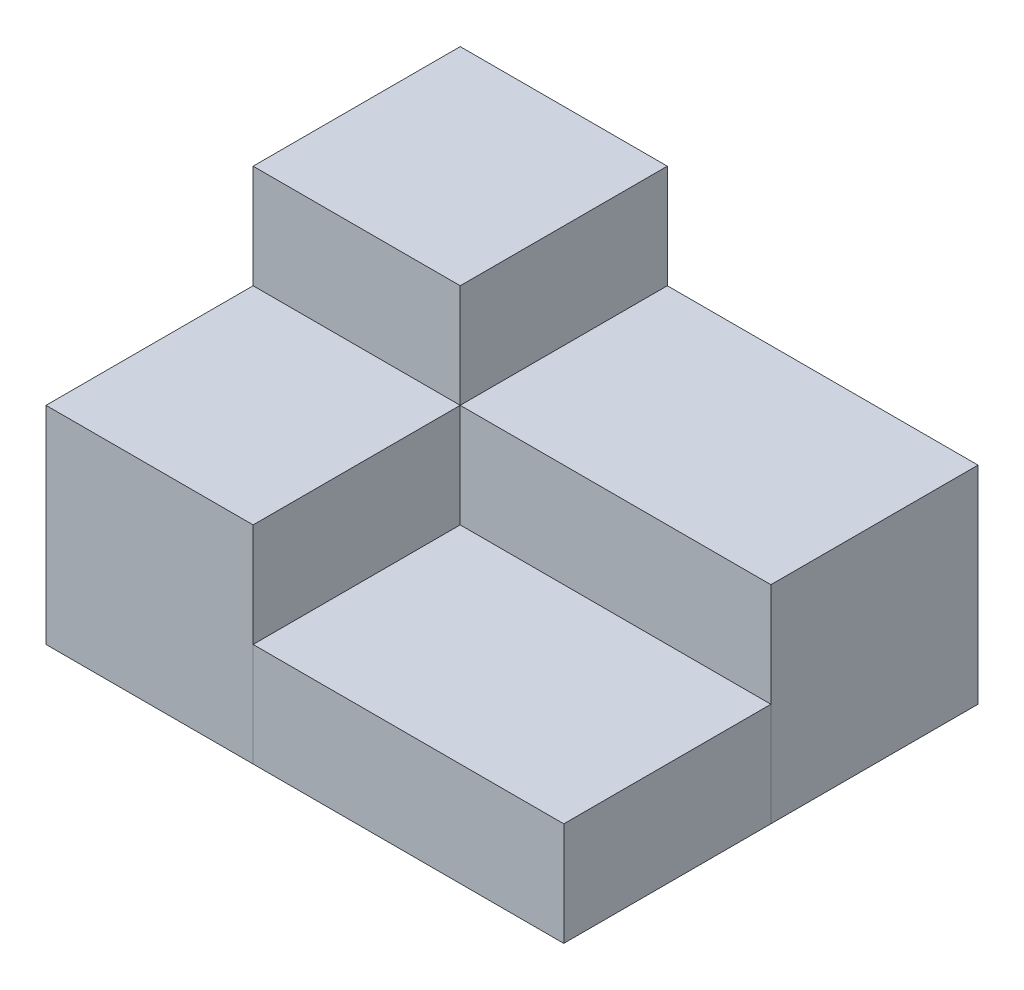
ISO-10303-21;
HEADER;
FILE_DESCRIPTION(('STEP AP214'),'2;1');
FILE_NAME('part.step','',(''),(''),'','','');
FILE_SCHEMA(('AUTOMOTIVE_DESIGN { 1 0 10303 214 1 1 1 1 }'));
ENDSEC;
DATA;
#1=APPLICATION_CONTEXT('core data for automotive mechanical design processes');
#2=APPLICATION_PROTOCOL_DEFINITION('international standard','automotive_design',2000,#1);
#3=PRODUCT_CONTEXT('',#1,'mechanical');
#4=PRODUCT('Part','Part','',(#3));
#5=PRODUCT_RELATED_PRODUCT_CATEGORY('part','',(#4));
#6=PRODUCT_DEFINITION_FORMATION('','',#4);
#7=PRODUCT_DEFINITION_CONTEXT('part definition',#1,'design');
#8=PRODUCT_DEFINITION('design','',#6,#7);
#9=PRODUCT_DEFINITION_SHAPE('','',#8);
#10=(LENGTH_UNIT() NAMED_UNIT(*) SI_UNIT(.MILLI.,.METRE.));
#11=(NAMED_UNIT(*) PLANE_ANGLE_UNIT() SI_UNIT($,.RADIAN.));
#12=(NAMED_UNIT(*) SI_UNIT($,.STERADIAN.) SOLID_ANGLE_UNIT());
#13=UNCERTAINTY_MEASURE_WITH_UNIT(LENGTH_MEASURE(1.E-05),#10,'distance_accuracy_value','');
#14=(GEOMETRIC_REPRESENTATION_CONTEXT(3) GLOBAL_UNCERTAINTY_ASSIGNED_CONTEXT((#13)) GLOBAL_UNIT_ASSIGNED_CONTEXT((#10,
#11,#12)) REPRESENTATION_CONTEXT('',''));
#15=CARTESIAN_POINT('',(0.,0.,0.));
#16=DIRECTION('',(0.,0.,1.));
#17=DIRECTION('',(1.,0.,0.));
#18=AXIS2_PLACEMENT_3D('',#15,#16,#17);
#19=CARTESIAN_POINT('',(0.,30.,0.));
#20=DIRECTION('',(-1.,0.,0.));
#21=DIRECTION('',(0.,0.,1.));
#22=AXIS2_PLACEMENT_3D('',#19,#20,#21);
#23=PLANE('',#22);
#24=DIRECTION('',(0.,0.,-1.));
#25=VECTOR('',#24,1.);
#26=CARTESIAN_POINT('',(0.,0.,0.));
#27=LINE('',#26,#25);
#28=CARTESIAN_POINT('',(0.,0.,-20.));
#29=VERTEX_POINT('',#28);
#30=CARTESIAN_POINT('',(0.,0.,-40.));
#31=VERTEX_POINT('',#30);
#32=EDGE_CURVE('E120',#29,#31,#27,.T.);
#33=ORIENTED_EDGE('',*,*,#32,.F.);
#34=DIRECTION('',(0.,-1.,0.));
#35=VECTOR('',#34,1.);
#36=CARTESIAN_POINT('',(0.,30.,-20.));
#37=LINE('',#36,#35);
#38=CARTESIAN_POINT('',(0.,30.,-20.));
#39=VERTEX_POINT('',#38);
#40=EDGE_CURVE('E12',#39,#29,#37,.T.);
#41=ORIENTED_EDGE('',*,*,#40,.F.);
#42=DIRECTION('',(0.,0.,-1.));
#43=VECTOR('',#42,1.);
#44=CARTESIAN_POINT('',(0.,30.,0.));
#45=LINE('',#44,#43);
#46=CARTESIAN_POINT('',(0.,30.,-40.));
#47=VERTEX_POINT('',#46);
#48=EDGE_CURVE('E101',#39,#47,#45,.T.);
#49=ORIENTED_EDGE('',*,*,#48,.T.);
#50=DIRECTION('',(0.,-1.,0.));
#51=VECTOR('',#50,1.);
#52=CARTESIAN_POINT('',(0.,30.,-40.));
#53=LINE('',#52,#51);
#54=EDGE_CURVE('E69',#47,#31,#53,.T.);
#55=ORIENTED_EDGE('',*,*,#54,.T.);
#56=EDGE_LOOP('',(#33,#41,#49,#55));
#57=FACE_BOUND('',#56,.T.);
#58=ADVANCED_FACE('F52',(#57),#23,.T.);
#59=CARTESIAN_POINT('',(0.,30.,-20.));
#60=DIRECTION('',(0.,0.,-1.));
#61=DIRECTION('',(-1.,0.,0.));
#62=AXIS2_PLACEMENT_3D('',#59,#60,#61);
#63=PLANE('',#62);
#64=DIRECTION('',(1.,0.,0.));
#65=VECTOR('',#64,1.);
#66=CARTESIAN_POINT('',(0.,0.,-20.));
#67=LINE('',#66,#65);
#68=CARTESIAN_POINT('',(20.,0.,-20.));
#69=VERTEX_POINT('',#68);
#70=EDGE_CURVE('E108',#29,#69,#67,.T.);
#71=ORIENTED_EDGE('',*,*,#70,.T.);
#72=DIRECTION('',(0.,-1.,0.));
#73=VECTOR('',#72,1.);
#74=CARTESIAN_POINT('',(20.,30.,-20.));
#75=LINE('',#74,#73);
#76=CARTESIAN_POINT('',(20.,30.,-20.));
#77=VERTEX_POINT('',#76);
#78=EDGE_CURVE('E61',#77,#69,#75,.T.);
#79=ORIENTED_EDGE('',*,*,#78,.F.);
#80=DIRECTION('',(1.,0.,0.));
#81=VECTOR('',#80,1.);
#82=CARTESIAN_POINT('',(0.,30.,-20.));
#83=LINE('',#82,#81);
#84=EDGE_CURVE('E95',#39,#77,#83,.T.);
#85=ORIENTED_EDGE('',*,*,#84,.F.);
#86=ORIENTED_EDGE('',*,*,#40,.T.);
#87=EDGE_LOOP('',(#71,#79,#85,#86));
#88=FACE_BOUND('',#87,.T.);
#89=ADVANCED_FACE('F106',(#88),#63,.F.);
#90=CARTESIAN_POINT('',(20.,30.,0.));
#91=DIRECTION('',(1.,0.,0.));
#92=DIRECTION('',(0.,0.,-1.));
#93=AXIS2_PLACEMENT_3D('',#90,#91,#92);
#94=PLANE('',#93);
#95=DIRECTION('',(0.,0.,1.));
#96=VECTOR('',#95,1.);
#97=CARTESIAN_POINT('',(20.,0.,0.));
#98=LINE('',#97,#96);
#99=CARTESIAN_POINT('',(20.,0.,-40.));
#100=VERTEX_POINT('',#99);
#101=EDGE_CURVE('E125',#100,#69,#98,.T.);
#102=ORIENTED_EDGE('',*,*,#101,.F.);
#103=DIRECTION('',(0.,-1.,0.));
#104=VECTOR('',#103,1.);
#105=CARTESIAN_POINT('',(20.,30.,-40.));
#106=LINE('',#105,#104);
#107=CARTESIAN_POINT('',(20.,30.,-40.));
#108=VERTEX_POINT('',#107);
#109=EDGE_CURVE('E82',#108,#100,#106,.T.);
#110=ORIENTED_EDGE('',*,*,#109,.F.);
#111=DIRECTION('',(0.,0.,1.));
#112=VECTOR('',#111,1.);
#113=CARTESIAN_POINT('',(20.,30.,0.));
#114=LINE('',#113,#112);
#115=EDGE_CURVE('E100',#108,#77,#114,.T.);
#116=ORIENTED_EDGE('',*,*,#115,.T.);
#117=ORIENTED_EDGE('',*,*,#78,.T.);
#118=EDGE_LOOP('',(#102,#110,#116,#117));
#119=FACE_BOUND('',#118,.T.);
#120=ADVANCED_FACE('F112',(#119),#94,.T.);
#121=CARTESIAN_POINT('',(0.,30.,-40.));
#122=DIRECTION('',(0.,0.,-1.));
#123=DIRECTION('',(-1.,0.,0.));
#124=AXIS2_PLACEMENT_3D('',#121,#122,#123);
#125=PLANE('',#124);
#126=DIRECTION('',(1.,0.,0.));
#127=VECTOR('',#126,1.);
#128=CARTESIAN_POINT('',(0.,0.,-40.));
#129=LINE('',#128,#127);
#130=EDGE_CURVE('E128',#31,#100,#129,.T.);
#131=ORIENTED_EDGE('',*,*,#130,.F.);
#132=ORIENTED_EDGE('',*,*,#54,.F.);
#133=DIRECTION('',(1.,0.,0.));
#134=VECTOR('',#133,1.);
#135=CARTESIAN_POINT('',(0.,30.,-40.));
#136=LINE('',#135,#134);
#137=EDGE_CURVE('E114',#47,#108,#136,.T.);
#138=ORIENTED_EDGE('',*,*,#137,.T.);
#139=ORIENTED_EDGE('',*,*,#109,.T.);
#140=EDGE_LOOP('',(#131,#132,#138,#139));
#141=FACE_BOUND('',#140,.T.);
#142=ADVANCED_FACE('F137',(#141),#125,.T.);
#143=CARTESIAN_POINT('',(0.,30.,0.));
#144=DIRECTION('',(0.,1.,0.));
#145=DIRECTION('',(0.,0.,1.));
#146=AXIS2_PLACEMENT_3D('',#143,#144,#145);
#147=PLANE('',#146);
#148=ORIENTED_EDGE('',*,*,#48,.F.);
#149=ORIENTED_EDGE('',*,*,#84,.T.);
#150=ORIENTED_EDGE('',*,*,#115,.F.);
#151=ORIENTED_EDGE('',*,*,#137,.F.);
#152=EDGE_LOOP('',(#148,#149,#150,#151));
#153=FACE_BOUND('',#152,.T.);
#154=ADVANCED_FACE('F97',(#153),#147,.T.);
#155=CARTESIAN_POINT('',(0.,0.,0.));
#156=DIRECTION('',(0.,1.,0.));
#157=DIRECTION('',(0.,0.,1.));
#158=AXIS2_PLACEMENT_3D('',#155,#156,#157);
#159=PLANE('',#158);
#160=ORIENTED_EDGE('',*,*,#32,.T.);
#161=ORIENTED_EDGE('',*,*,#130,.T.);
#162=ORIENTED_EDGE('',*,*,#101,.T.);
#163=ORIENTED_EDGE('',*,*,#70,.F.);
#164=EDGE_LOOP('',(#160,#161,#162,#163));
#165=FACE_BOUND('',#164,.T.);
#166=ADVANCED_FACE('F144',(#165),#159,.F.);
#167=CLOSED_SHELL('',(#58,#89,#120,#142,#154,#166));
#168=MANIFOLD_SOLID_BREP('B2',#167);
#169=CARTESIAN_POINT('',(0.,10.,-20.));
#170=DIRECTION('',(0.,0.,-1.));
#171=DIRECTION('',(-1.,0.,0.));
#172=AXIS2_PLACEMENT_3D('',#169,#170,#171);
#173=PLANE('',#172);
#174=DIRECTION('',(1.,0.,0.));
#175=VECTOR('',#174,1.);
#176=CARTESIAN_POINT('',(0.,0.,-20.));
#177=LINE('',#176,#175);
#178=CARTESIAN_POINT('',(20.,0.,-20.));
#179=VERTEX_POINT('',#178);
#180=CARTESIAN_POINT('',(50.,0.,-20.));
#181=VERTEX_POINT('',#180);
#182=EDGE_CURVE('E260',#179,#181,#177,.T.);
#183=ORIENTED_EDGE('',*,*,#182,.F.);
#184=DIRECTION('',(0.,-1.,0.));
#185=VECTOR('',#184,1.);
#186=CARTESIAN_POINT('',(20.,10.,-20.));
#187=LINE('',#186,#185);
#188=CARTESIAN_POINT('',(20.,10.,-20.));
#189=VERTEX_POINT('',#188);
#190=EDGE_CURVE('E50',#189,#179,#187,.T.);
#191=ORIENTED_EDGE('',*,*,#190,.F.);
#192=DIRECTION('',(1.,0.,0.));
#193=VECTOR('',#192,1.);
#194=CARTESIAN_POINT('',(0.,10.,-20.));
#195=LINE('',#194,#193);
#196=CARTESIAN_POINT('',(50.,10.,-20.));
#197=VERTEX_POINT('',#196);
#198=EDGE_CURVE('E248',#189,#197,#195,.T.);
#199=ORIENTED_EDGE('',*,*,#198,.T.);
#200=DIRECTION('',(0.,-1.,0.));
#201=VECTOR('',#200,1.);
#202=CARTESIAN_POINT('',(50.,10.,-20.));
#203=LINE('',#202,#201);
#204=EDGE_CURVE('E237',#197,#181,#203,.T.);
#205=ORIENTED_EDGE('',*,*,#204,.T.);
#206=EDGE_LOOP('',(#183,#191,#199,#205));
#207=FACE_BOUND('',#206,.T.);
#208=ADVANCED_FACE('F198',(#207),#173,.T.);
#209=CARTESIAN_POINT('',(20.,10.,0.));
#210=DIRECTION('',(1.,0.,0.));
#211=DIRECTION('',(0.,0.,-1.));
#212=AXIS2_PLACEMENT_3D('',#209,#210,#211);
#213=PLANE('',#212);
#214=DIRECTION('',(0.,0.,1.));
#215=VECTOR('',#214,1.);
#216=CARTESIAN_POINT('',(20.,0.,0.));
#217=LINE('',#216,#215);
#218=CARTESIAN_POINT('',(20.,0.,0.));
#219=VERTEX_POINT('',#218);
#220=EDGE_CURVE('E253',#179,#219,#217,.T.);
#221=ORIENTED_EDGE('',*,*,#220,.T.);
#222=DIRECTION('',(0.,-1.,0.));
#223=VECTOR('',#222,1.);
#224=CARTESIAN_POINT('',(20.,10.,0.));
#225=LINE('',#224,#223);
#226=CARTESIAN_POINT('',(20.,10.,0.));
#227=VERTEX_POINT('',#226);
#228=EDGE_CURVE('E206',#227,#219,#225,.T.);
#229=ORIENTED_EDGE('',*,*,#228,.F.);
#230=DIRECTION('',(0.,0.,1.));
#231=VECTOR('',#230,1.);
#232=CARTESIAN_POINT('',(20.,10.,0.));
#233=LINE('',#232,#231);
#234=EDGE_CURVE('E243',#189,#227,#233,.T.);
#235=ORIENTED_EDGE('',*,*,#234,.F.);
#236=ORIENTED_EDGE('',*,*,#190,.T.);
#237=EDGE_LOOP('',(#221,#229,#235,#236));
#238=FACE_BOUND('',#237,.T.);
#239=ADVANCED_FACE('F251',(#238),#213,.F.);
#240=CARTESIAN_POINT('',(0.,10.,0.));
#241=DIRECTION('',(0.,0.,-1.));
#242=DIRECTION('',(-1.,0.,0.));
#243=AXIS2_PLACEMENT_3D('',#240,#241,#242);
#244=PLANE('',#243);
#245=DIRECTION('',(1.,0.,0.));
#246=VECTOR('',#245,1.);
#247=CARTESIAN_POINT('',(0.,0.,0.));
#248=LINE('',#247,#246);
#249=CARTESIAN_POINT('',(50.,0.,0.));
#250=VERTEX_POINT('',#249);
#251=EDGE_CURVE('E230',#219,#250,#248,.T.);
#252=ORIENTED_EDGE('',*,*,#251,.T.);
#253=DIRECTION('',(0.,-1.,0.));
#254=VECTOR('',#253,1.);
#255=CARTESIAN_POINT('',(50.,10.,0.));
#256=LINE('',#255,#254);
#257=CARTESIAN_POINT('',(50.,10.,0.));
#258=VERTEX_POINT('',#257);
#259=EDGE_CURVE('E254',#258,#250,#256,.T.);
#260=ORIENTED_EDGE('',*,*,#259,.F.);
#261=DIRECTION('',(1.,0.,0.));
#262=VECTOR('',#261,1.);
#263=CARTESIAN_POINT('',(0.,10.,0.));
#264=LINE('',#263,#262);
#265=EDGE_CURVE('E247',#227,#258,#264,.T.);
#266=ORIENTED_EDGE('',*,*,#265,.F.);
#267=ORIENTED_EDGE('',*,*,#228,.T.);
#268=EDGE_LOOP('',(#252,#260,#266,#267));
#269=FACE_BOUND('',#268,.T.);
#270=ADVANCED_FACE('F255',(#269),#244,.F.);
#271=CARTESIAN_POINT('',(50.,10.,0.));
#272=DIRECTION('',(-1.,0.,0.));
#273=DIRECTION('',(0.,0.,1.));
#274=AXIS2_PLACEMENT_3D('',#271,#272,#273);
#275=PLANE('',#274);
#276=DIRECTION('',(0.,0.,-1.));
#277=VECTOR('',#276,1.);
#278=CARTESIAN_POINT('',(50.,0.,0.));
#279=LINE('',#278,#277);
#280=EDGE_CURVE('E265',#250,#181,#279,.T.);
#281=ORIENTED_EDGE('',*,*,#280,.T.);
#282=ORIENTED_EDGE('',*,*,#204,.F.);
#283=DIRECTION('',(0.,0.,-1.));
#284=VECTOR('',#283,1.);
#285=CARTESIAN_POINT('',(50.,10.,0.));
#286=LINE('',#285,#284);
#287=EDGE_CURVE('E214',#258,#197,#286,.T.);
#288=ORIENTED_EDGE('',*,*,#287,.F.);
#289=ORIENTED_EDGE('',*,*,#259,.T.);
#290=EDGE_LOOP('',(#281,#282,#288,#289));
#291=FACE_BOUND('',#290,.T.);
#292=ADVANCED_FACE('F270',(#291),#275,.F.);
#293=CARTESIAN_POINT('',(0.,10.,0.));
#294=DIRECTION('',(0.,1.,0.));
#295=DIRECTION('',(0.,0.,1.));
#296=AXIS2_PLACEMENT_3D('',#293,#294,#295);
#297=PLANE('',#296);
#298=ORIENTED_EDGE('',*,*,#198,.F.);
#299=ORIENTED_EDGE('',*,*,#234,.T.);
#300=ORIENTED_EDGE('',*,*,#265,.T.);
#301=ORIENTED_EDGE('',*,*,#287,.T.);
#302=EDGE_LOOP('',(#298,#299,#300,#301));
#303=FACE_BOUND('',#302,.T.);
#304=ADVANCED_FACE('F245',(#303),#297,.T.);
#305=CARTESIAN_POINT('',(0.,0.,0.));
#306=DIRECTION('',(0.,1.,0.));
#307=DIRECTION('',(0.,0.,1.));
#308=AXIS2_PLACEMENT_3D('',#305,#306,#307);
#309=PLANE('',#308);
#310=ORIENTED_EDGE('',*,*,#182,.T.);
#311=ORIENTED_EDGE('',*,*,#280,.F.);
#312=ORIENTED_EDGE('',*,*,#251,.F.);
#313=ORIENTED_EDGE('',*,*,#220,.F.);
#314=EDGE_LOOP('',(#310,#311,#312,#313));
#315=FACE_BOUND('',#314,.T.);
#316=ADVANCED_FACE('F272',(#315),#309,.F.);
#317=CLOSED_SHELL('',(#208,#239,#270,#292,#304,#316));
#318=MANIFOLD_SOLID_BREP('B6',#317);
#319=CARTESIAN_POINT('',(20.,20.,0.));
#320=DIRECTION('',(1.,0.,0.));
#321=DIRECTION('',(0.,0.,-1.));
#322=AXIS2_PLACEMENT_3D('',#319,#320,#321);
#323=PLANE('',#322);
#324=DIRECTION('',(0.,0.,1.));
#325=VECTOR('',#324,1.);
#326=CARTESIAN_POINT('',(20.,0.,0.));
#327=LINE('',#326,#325);
#328=CARTESIAN_POINT('',(20.,0.,-40.));
#329=VERTEX_POINT('',#328);
#330=CARTESIAN_POINT('',(20.,0.,-20.));
#331=VERTEX_POINT('',#330);
#332=EDGE_CURVE('E394',#329,#331,#327,.T.);
#333=ORIENTED_EDGE('',*,*,#332,.T.);
#334=DIRECTION('',(0.,-1.,0.));
#335=VECTOR('',#334,1.);
#336=CARTESIAN_POINT('',(20.,20.,-20.));
#337=LINE('',#336,#335);
#338=CARTESIAN_POINT('',(20.,20.,-20.));
#339=VERTEX_POINT('',#338);
#340=EDGE_CURVE('E196',#339,#331,#337,.T.);
#341=ORIENTED_EDGE('',*,*,#340,.F.);
#342=DIRECTION('',(0.,0.,1.));
#343=VECTOR('',#342,1.);
#344=CARTESIAN_POINT('',(20.,20.,0.));
#345=LINE('',#344,#343);
#346=CARTESIAN_POINT('',(20.,20.,-40.));
#347=VERTEX_POINT('',#346);
#348=EDGE_CURVE('E380',#347,#339,#345,.T.);
#349=ORIENTED_EDGE('',*,*,#348,.F.);
#350=DIRECTION('',(0.,-1.,0.));
#351=VECTOR('',#350,1.);
#352=CARTESIAN_POINT('',(20.,20.,-40.));
#353=LINE('',#352,#351);
#354=EDGE_CURVE('E347',#347,#329,#353,.T.);
#355=ORIENTED_EDGE('',*,*,#354,.T.);
#356=EDGE_LOOP('',(#333,#341,#349,#355));
#357=FACE_BOUND('',#356,.T.);
#358=ADVANCED_FACE('F331',(#357),#323,.F.);
#359=CARTESIAN_POINT('',(0.,20.,-20.));
#360=DIRECTION('',(0.,0.,-1.));
#361=DIRECTION('',(-1.,0.,0.));
#362=AXIS2_PLACEMENT_3D('',#359,#360,#361);
#363=PLANE('',#362);
#364=DIRECTION('',(1.,0.,0.));
#365=VECTOR('',#364,1.);
#366=CARTESIAN_POINT('',(0.,0.,-20.));
#367=LINE('',#366,#365);
#368=CARTESIAN_POINT('',(50.,0.,-20.));
#369=VERTEX_POINT('',#368);
#370=EDGE_CURVE('E385',#331,#369,#367,.T.);
#371=ORIENTED_EDGE('',*,*,#370,.T.);
#372=DIRECTION('',(0.,-1.,0.));
#373=VECTOR('',#372,1.);
#374=CARTESIAN_POINT('',(50.,20.,-20.));
#375=LINE('',#374,#373);
#376=CARTESIAN_POINT('',(50.,20.,-20.));
#377=VERTEX_POINT('',#376);
#378=EDGE_CURVE('E339',#377,#369,#375,.T.);
#379=ORIENTED_EDGE('',*,*,#378,.F.);
#380=DIRECTION('',(1.,0.,0.));
#381=VECTOR('',#380,1.);
#382=CARTESIAN_POINT('',(0.,20.,-20.));
#383=LINE('',#382,#381);
#384=EDGE_CURVE('E373',#339,#377,#383,.T.);
#385=ORIENTED_EDGE('',*,*,#384,.F.);
#386=ORIENTED_EDGE('',*,*,#340,.T.);
#387=EDGE_LOOP('',(#371,#379,#385,#386));
#388=FACE_BOUND('',#387,.T.);
#389=ADVANCED_FACE('F384',(#388),#363,.F.);
#390=CARTESIAN_POINT('',(50.,20.,0.));
#391=DIRECTION('',(-1.,0.,0.));
#392=DIRECTION('',(0.,0.,1.));
#393=AXIS2_PLACEMENT_3D('',#390,#391,#392);
#394=PLANE('',#393);
#395=DIRECTION('',(0.,0.,-1.));
#396=VECTOR('',#395,1.);
#397=CARTESIAN_POINT('',(50.,0.,0.));
#398=LINE('',#397,#396);
#399=CARTESIAN_POINT('',(50.,0.,-40.));
#400=VERTEX_POINT('',#399);
#401=EDGE_CURVE('E397',#369,#400,#398,.T.);
#402=ORIENTED_EDGE('',*,*,#401,.T.);
#403=DIRECTION('',(0.,-1.,0.));
#404=VECTOR('',#403,1.);
#405=CARTESIAN_POINT('',(50.,20.,-40.));
#406=LINE('',#405,#404);
#407=CARTESIAN_POINT('',(50.,20.,-40.));
#408=VERTEX_POINT('',#407);
#409=EDGE_CURVE('E362',#408,#400,#406,.T.);
#410=ORIENTED_EDGE('',*,*,#409,.F.);
#411=DIRECTION('',(0.,0.,-1.));
#412=VECTOR('',#411,1.);
#413=CARTESIAN_POINT('',(50.,20.,0.));
#414=LINE('',#413,#412);
#415=EDGE_CURVE('E379',#377,#408,#414,.T.);
#416=ORIENTED_EDGE('',*,*,#415,.F.);
#417=ORIENTED_EDGE('',*,*,#378,.T.);
#418=EDGE_LOOP('',(#402,#410,#416,#417));
#419=FACE_BOUND('',#418,.T.);
#420=ADVANCED_FACE('F388',(#419),#394,.F.);
#421=CARTESIAN_POINT('',(0.,20.,-40.));
#422=DIRECTION('',(0.,0.,-1.));
#423=DIRECTION('',(-1.,0.,0.));
#424=AXIS2_PLACEMENT_3D('',#421,#422,#423);
#425=PLANE('',#424);
#426=DIRECTION('',(1.,0.,0.));
#427=VECTOR('',#426,1.);
#428=CARTESIAN_POINT('',(0.,0.,-40.));
#429=LINE('',#428,#427);
#430=EDGE_CURVE('E399',#329,#400,#429,.T.);
#431=ORIENTED_EDGE('',*,*,#430,.F.);
#432=ORIENTED_EDGE('',*,*,#354,.F.);
#433=DIRECTION('',(1.,0.,0.));
#434=VECTOR('',#433,1.);
#435=CARTESIAN_POINT('',(0.,20.,-40.));
#436=LINE('',#435,#434);
#437=EDGE_CURVE('E389',#347,#408,#436,.T.);
#438=ORIENTED_EDGE('',*,*,#437,.T.);
#439=ORIENTED_EDGE('',*,*,#409,.T.);
#440=EDGE_LOOP('',(#431,#432,#438,#439));
#441=FACE_BOUND('',#440,.T.);
#442=ADVANCED_FACE('F405',(#441),#425,.T.);
#443=CARTESIAN_POINT('',(0.,20.,0.));
#444=DIRECTION('',(0.,1.,0.));
#445=DIRECTION('',(0.,0.,1.));
#446=AXIS2_PLACEMENT_3D('',#443,#444,#445);
#447=PLANE('',#446);
#448=ORIENTED_EDGE('',*,*,#348,.T.);
#449=ORIENTED_EDGE('',*,*,#384,.T.);
#450=ORIENTED_EDGE('',*,*,#415,.T.);
#451=ORIENTED_EDGE('',*,*,#437,.F.);
#452=EDGE_LOOP('',(#448,#449,#450,#451));
#453=FACE_BOUND('',#452,.T.);
#454=ADVANCED_FACE('F376',(#453),#447,.T.);
#455=CARTESIAN_POINT('',(0.,0.,0.));
#456=DIRECTION('',(0.,1.,0.));
#457=DIRECTION('',(0.,0.,1.));
#458=AXIS2_PLACEMENT_3D('',#455,#456,#457);
#459=PLANE('',#458);
#460=ORIENTED_EDGE('',*,*,#332,.F.);
#461=ORIENTED_EDGE('',*,*,#430,.T.);
#462=ORIENTED_EDGE('',*,*,#401,.F.);
#463=ORIENTED_EDGE('',*,*,#370,.F.);
#464=EDGE_LOOP('',(#460,#461,#462,#463));
#465=FACE_BOUND('',#464,.T.);
#466=ADVANCED_FACE('F404',(#465),#459,.F.);
#467=CLOSED_SHELL('',(#358,#389,#420,#442,#454,#466));
#468=MANIFOLD_SOLID_BREP('B44',#467);
#469=CARTESIAN_POINT('',(0.,20.,-20.));
#470=DIRECTION('',(0.,0.,-1.));
#471=DIRECTION('',(-1.,0.,0.));
#472=AXIS2_PLACEMENT_3D('',#469,#470,#471);
#473=PLANE('',#472);
#474=DIRECTION('',(1.,0.,0.));
#475=VECTOR('',#474,1.);
#476=CARTESIAN_POINT('',(0.,0.,-20.));
#477=LINE('',#476,#475);
#478=CARTESIAN_POINT('',(0.,0.,-20.));
#479=VERTEX_POINT('',#478);
#480=CARTESIAN_POINT('',(20.,0.,-20.));
#481=VERTEX_POINT('',#480);
#482=EDGE_CURVE('E519',#479,#481,#477,.T.);
#483=ORIENTED_EDGE('',*,*,#482,.F.);
#484=DIRECTION('',(0.,-1.,0.));
#485=VECTOR('',#484,1.);
#486=CARTESIAN_POINT('',(0.,20.,-20.));
#487=LINE('',#486,#485);
#488=CARTESIAN_POINT('',(0.,20.,-20.));
#489=VERTEX_POINT('',#488);
#490=EDGE_CURVE('E329',#489,#479,#487,.T.);
#491=ORIENTED_EDGE('',*,*,#490,.F.);
#492=DIRECTION('',(1.,0.,0.));
#493=VECTOR('',#492,1.);
#494=CARTESIAN_POINT('',(0.,20.,-20.));
#495=LINE('',#494,#493);
#496=CARTESIAN_POINT('',(20.,20.,-20.));
#497=VERTEX_POINT('',#496);
#498=EDGE_CURVE('E513',#489,#497,#495,.T.);
#499=ORIENTED_EDGE('',*,*,#498,.T.);
#500=DIRECTION('',(0.,-1.,0.));
#501=VECTOR('',#500,1.);
#502=CARTESIAN_POINT('',(20.,20.,-20.));
#503=LINE('',#502,#501);
#504=EDGE_CURVE('E471',#497,#481,#503,.T.);
#505=ORIENTED_EDGE('',*,*,#504,.T.);
#506=EDGE_LOOP('',(#483,#491,#499,#505));
#507=FACE_BOUND('',#506,.T.);
#508=ADVANCED_FACE('F455',(#507),#473,.T.);
#509=CARTESIAN_POINT('',(0.,20.,0.));
#510=DIRECTION('',(-1.,0.,0.));
#511=DIRECTION('',(0.,0.,1.));
#512=AXIS2_PLACEMENT_3D('',#509,#510,#511);
#513=PLANE('',#512);
#514=DIRECTION('',(0.,0.,-1.));
#515=VECTOR('',#514,1.);
#516=CARTESIAN_POINT('',(0.,0.,0.));
#517=LINE('',#516,#515);
#518=CARTESIAN_POINT('',(0.,0.,0.));
#519=VERTEX_POINT('',#518);
#520=EDGE_CURVE('E503',#519,#479,#517,.T.);
#521=ORIENTED_EDGE('',*,*,#520,.F.);
#522=DIRECTION('',(0.,-1.,0.));
#523=VECTOR('',#522,1.);
#524=CARTESIAN_POINT('',(0.,20.,0.));
#525=LINE('',#524,#523);
#526=CARTESIAN_POINT('',(0.,20.,0.));
#527=VERTEX_POINT('',#526);
#528=EDGE_CURVE('E463',#527,#519,#525,.T.);
#529=ORIENTED_EDGE('',*,*,#528,.F.);
#530=DIRECTION('',(0.,0.,-1.));
#531=VECTOR('',#530,1.);
#532=CARTESIAN_POINT('',(0.,20.,0.));
#533=LINE('',#532,#531);
#534=EDGE_CURVE('E501',#527,#489,#533,.T.);
#535=ORIENTED_EDGE('',*,*,#534,.T.);
#536=ORIENTED_EDGE('',*,*,#490,.T.);
#537=EDGE_LOOP('',(#521,#529,#535,#536));
#538=FACE_BOUND('',#537,.T.);
#539=ADVANCED_FACE('F499',(#538),#513,.T.);
#540=CARTESIAN_POINT('',(0.,20.,0.));
#541=DIRECTION('',(0.,0.,-1.));
#542=DIRECTION('',(-1.,0.,0.));
#543=AXIS2_PLACEMENT_3D('',#540,#541,#542);
#544=PLANE('',#543);
#545=DIRECTION('',(1.,0.,0.));
#546=VECTOR('',#545,1.);
#547=CARTESIAN_POINT('',(0.,0.,0.));
#548=LINE('',#547,#546);
#549=CARTESIAN_POINT('',(20.,0.,0.));
#550=VERTEX_POINT('',#549);
#551=EDGE_CURVE('E522',#519,#550,#548,.T.);
#552=ORIENTED_EDGE('',*,*,#551,.T.);
#553=DIRECTION('',(0.,-1.,0.));
#554=VECTOR('',#553,1.);
#555=CARTESIAN_POINT('',(20.,20.,0.));
#556=LINE('',#555,#554);
#557=CARTESIAN_POINT('',(20.,20.,0.));
#558=VERTEX_POINT('',#557);
#559=EDGE_CURVE('E485',#558,#550,#556,.T.);
#560=ORIENTED_EDGE('',*,*,#559,.F.);
#561=DIRECTION('',(1.,0.,0.));
#562=VECTOR('',#561,1.);
#563=CARTESIAN_POINT('',(0.,20.,0.));
#564=LINE('',#563,#562);
#565=EDGE_CURVE('E506',#527,#558,#564,.T.);
#566=ORIENTED_EDGE('',*,*,#565,.F.);
#567=ORIENTED_EDGE('',*,*,#528,.T.);
#568=EDGE_LOOP('',(#552,#560,#566,#567));
#569=FACE_BOUND('',#568,.T.);
#570=ADVANCED_FACE('F507',(#569),#544,.F.);
#571=CARTESIAN_POINT('',(20.,20.,0.));
#572=DIRECTION('',(1.,0.,0.));
#573=DIRECTION('',(0.,0.,-1.));
#574=AXIS2_PLACEMENT_3D('',#571,#572,#573);
#575=PLANE('',#574);
#576=DIRECTION('',(0.,0.,1.));
#577=VECTOR('',#576,1.);
#578=CARTESIAN_POINT('',(20.,0.,0.));
#579=LINE('',#578,#577);
#580=EDGE_CURVE('E515',#481,#550,#579,.T.);
#581=ORIENTED_EDGE('',*,*,#580,.F.);
#582=ORIENTED_EDGE('',*,*,#504,.F.);
#583=DIRECTION('',(0.,0.,1.));
#584=VECTOR('',#583,1.);
#585=CARTESIAN_POINT('',(20.,20.,0.));
#586=LINE('',#585,#584);
#587=EDGE_CURVE('E510',#497,#558,#586,.T.);
#588=ORIENTED_EDGE('',*,*,#587,.T.);
#589=ORIENTED_EDGE('',*,*,#559,.T.);
#590=EDGE_LOOP('',(#581,#582,#588,#589));
#591=FACE_BOUND('',#590,.T.);
#592=ADVANCED_FACE('F529',(#591),#575,.T.);
#593=CARTESIAN_POINT('',(0.,20.,0.));
#594=DIRECTION('',(0.,1.,0.));
#595=DIRECTION('',(0.,0.,1.));
#596=AXIS2_PLACEMENT_3D('',#593,#594,#595);
#597=PLANE('',#596);
#598=ORIENTED_EDGE('',*,*,#498,.F.);
#599=ORIENTED_EDGE('',*,*,#534,.F.);
#600=ORIENTED_EDGE('',*,*,#565,.T.);
#601=ORIENTED_EDGE('',*,*,#587,.F.);
#602=EDGE_LOOP('',(#598,#599,#600,#601));
#603=FACE_BOUND('',#602,.T.);
#604=ADVANCED_FACE('F512',(#603),#597,.T.);
#605=CARTESIAN_POINT('',(0.,0.,0.));
#606=DIRECTION('',(0.,1.,0.));
#607=DIRECTION('',(0.,0.,1.));
#608=AXIS2_PLACEMENT_3D('',#605,#606,#607);
#609=PLANE('',#608);
#610=ORIENTED_EDGE('',*,*,#482,.T.);
#611=ORIENTED_EDGE('',*,*,#580,.T.);
#612=ORIENTED_EDGE('',*,*,#551,.F.);
#613=ORIENTED_EDGE('',*,*,#520,.T.);
#614=EDGE_LOOP('',(#610,#611,#612,#613));
#615=FACE_BOUND('',#614,.T.);
#616=ADVANCED_FACE('F528',(#615),#609,.F.);
#617=CLOSED_SHELL('',(#508,#539,#570,#592,#604,#616));
#618=MANIFOLD_SOLID_BREP('B190',#617);
#619=ADVANCED_BREP_SHAPE_REPRESENTATION('',(#18,#168,#318,#468,#618),#14);
#620=SHAPE_DEFINITION_REPRESENTATION(#9,#619);
ENDSEC;
END-ISO-10303-21;
